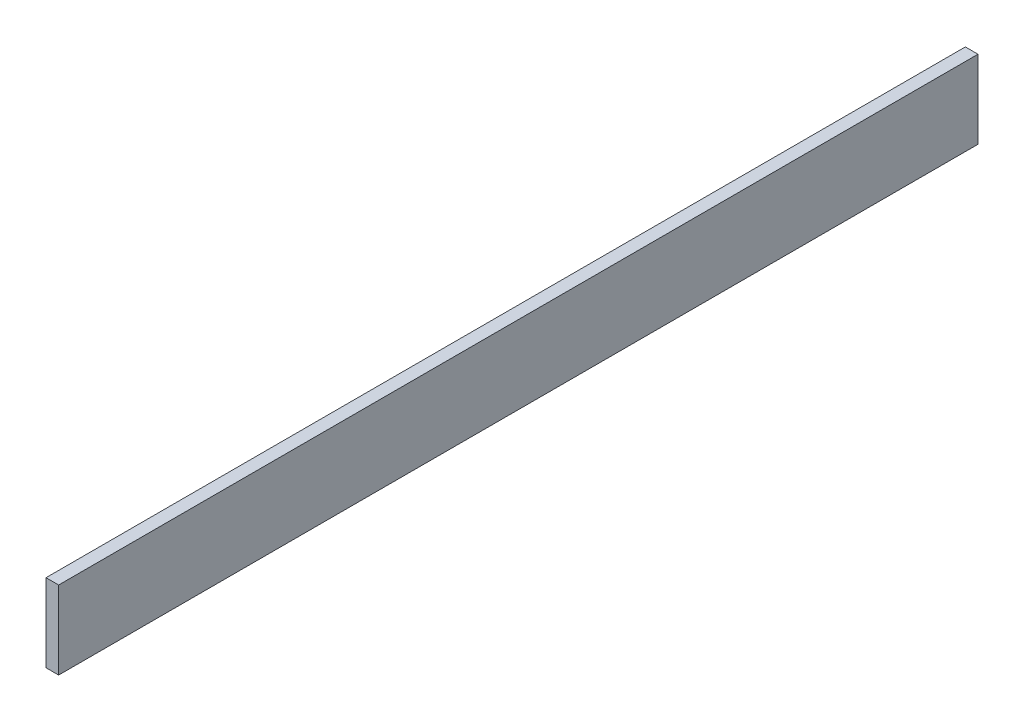
ISO-10303-21;
HEADER;
FILE_DESCRIPTION(('STEP AP214'),'2;1');
FILE_NAME('part.step','',(''),(''),'','','');
FILE_SCHEMA(('AUTOMOTIVE_DESIGN { 1 0 10303 214 1 1 1 1 }'));
ENDSEC;
DATA;
#1=APPLICATION_CONTEXT('core data for automotive mechanical design processes');
#2=APPLICATION_PROTOCOL_DEFINITION('international standard','automotive_design',2000,#1);
#3=PRODUCT_CONTEXT('',#1,'mechanical');
#4=PRODUCT('Part','Part','',(#3));
#5=PRODUCT_RELATED_PRODUCT_CATEGORY('part','',(#4));
#6=PRODUCT_DEFINITION_FORMATION('','',#4);
#7=PRODUCT_DEFINITION_CONTEXT('part definition',#1,'design');
#8=PRODUCT_DEFINITION('design','',#6,#7);
#9=PRODUCT_DEFINITION_SHAPE('','',#8);
#10=(LENGTH_UNIT() NAMED_UNIT(*) SI_UNIT(.MILLI.,.METRE.));
#11=(NAMED_UNIT(*) PLANE_ANGLE_UNIT() SI_UNIT($,.RADIAN.));
#12=(NAMED_UNIT(*) SI_UNIT($,.STERADIAN.) SOLID_ANGLE_UNIT());
#13=UNCERTAINTY_MEASURE_WITH_UNIT(LENGTH_MEASURE(1.E-05),#10,'distance_accuracy_value','');
#14=(GEOMETRIC_REPRESENTATION_CONTEXT(3) GLOBAL_UNCERTAINTY_ASSIGNED_CONTEXT((#13)) GLOBAL_UNIT_ASSIGNED_CONTEXT((#10,
#11,#12)) REPRESENTATION_CONTEXT('',''));
#15=CARTESIAN_POINT('',(0.,0.,0.));
#16=DIRECTION('',(0.,0.,1.));
#17=DIRECTION('',(1.,0.,0.));
#18=AXIS2_PLACEMENT_3D('',#15,#16,#17);
#19=CARTESIAN_POINT('',(38.1,0.,0.));
#20=DIRECTION('',(0.,0.,-1.));
#21=DIRECTION('',(-1.,0.,0.));
#22=AXIS2_PLACEMENT_3D('',#19,#20,#21);
#23=PLANE('',#22);
#24=DIRECTION('',(0.,-1.,0.));
#25=VECTOR('',#24,1.);
#26=CARTESIAN_POINT('',(0.,0.,0.));
#27=LINE('',#26,#25);
#28=CARTESIAN_POINT('',(0.,234.95,0.));
#29=VERTEX_POINT('',#28);
#30=CARTESIAN_POINT('',(0.,0.,0.));
#31=VERTEX_POINT('',#30);
#32=EDGE_CURVE('E96',#29,#31,#27,.T.);
#33=ORIENTED_EDGE('',*,*,#32,.T.);
#34=DIRECTION('',(-1.,0.,0.));
#35=VECTOR('',#34,1.);
#36=CARTESIAN_POINT('',(38.1,0.,0.));
#37=LINE('',#36,#35);
#38=CARTESIAN_POINT('',(38.1,0.,0.));
#39=VERTEX_POINT('',#38);
#40=EDGE_CURVE('E11',#39,#31,#37,.T.);
#41=ORIENTED_EDGE('',*,*,#40,.F.);
#42=DIRECTION('',(0.,-1.,0.));
#43=VECTOR('',#42,1.);
#44=CARTESIAN_POINT('',(38.1,0.,0.));
#45=LINE('',#44,#43);
#46=CARTESIAN_POINT('',(38.1,234.95,0.));
#47=VERTEX_POINT('',#46);
#48=EDGE_CURVE('E84',#47,#39,#45,.T.);
#49=ORIENTED_EDGE('',*,*,#48,.F.);
#50=DIRECTION('',(-1.,0.,0.));
#51=VECTOR('',#50,1.);
#52=CARTESIAN_POINT('',(38.1,234.95,0.));
#53=LINE('',#52,#51);
#54=EDGE_CURVE('E92',#47,#29,#53,.T.);
#55=ORIENTED_EDGE('',*,*,#54,.T.);
#56=EDGE_LOOP('',(#33,#41,#49,#55));
#57=FACE_BOUND('',#56,.T.);
#58=ADVANCED_FACE('F33',(#57),#23,.F.);
#59=CARTESIAN_POINT('',(38.1,0.,0.));
#60=DIRECTION('',(0.,1.,0.));
#61=DIRECTION('',(0.,0.,1.));
#62=AXIS2_PLACEMENT_3D('',#59,#60,#61);
#63=PLANE('',#62);
#64=DIRECTION('',(0.,0.,-1.));
#65=VECTOR('',#64,1.);
#66=CARTESIAN_POINT('',(0.,0.,0.));
#67=LINE('',#66,#65);
#68=CARTESIAN_POINT('',(0.,0.,-2768.6));
#69=VERTEX_POINT('',#68);
#70=EDGE_CURVE('E88',#31,#69,#67,.T.);
#71=ORIENTED_EDGE('',*,*,#70,.T.);
#72=DIRECTION('',(-1.,0.,0.));
#73=VECTOR('',#72,1.);
#74=CARTESIAN_POINT('',(38.1,0.,-2768.6));
#75=LINE('',#74,#73);
#76=CARTESIAN_POINT('',(38.1,0.,-2768.6));
#77=VERTEX_POINT('',#76);
#78=EDGE_CURVE('E41',#77,#69,#75,.T.);
#79=ORIENTED_EDGE('',*,*,#78,.F.);
#80=DIRECTION('',(0.,0.,-1.));
#81=VECTOR('',#80,1.);
#82=CARTESIAN_POINT('',(38.1,0.,0.));
#83=LINE('',#82,#81);
#84=EDGE_CURVE('E79',#39,#77,#83,.T.);
#85=ORIENTED_EDGE('',*,*,#84,.F.);
#86=ORIENTED_EDGE('',*,*,#40,.T.);
#87=EDGE_LOOP('',(#71,#79,#85,#86));
#88=FACE_BOUND('',#87,.T.);
#89=ADVANCED_FACE('F87',(#88),#63,.F.);
#90=CARTESIAN_POINT('',(38.1,0.,-2768.6));
#91=DIRECTION('',(0.,0.,1.));
#92=DIRECTION('',(1.,0.,0.));
#93=AXIS2_PLACEMENT_3D('',#90,#91,#92);
#94=PLANE('',#93);
#95=DIRECTION('',(0.,1.,0.));
#96=VECTOR('',#95,1.);
#97=CARTESIAN_POINT('',(0.,0.,-2768.6));
#98=LINE('',#97,#96);
#99=CARTESIAN_POINT('',(0.,234.95,-2768.6));
#100=VERTEX_POINT('',#99);
#101=EDGE_CURVE('E66',#69,#100,#98,.T.);
#102=ORIENTED_EDGE('',*,*,#101,.T.);
#103=DIRECTION('',(-1.,0.,0.));
#104=VECTOR('',#103,1.);
#105=CARTESIAN_POINT('',(38.1,234.95,-2768.6));
#106=LINE('',#105,#104);
#107=CARTESIAN_POINT('',(38.1,234.95,-2768.6));
#108=VERTEX_POINT('',#107);
#109=EDGE_CURVE('E89',#108,#100,#106,.T.);
#110=ORIENTED_EDGE('',*,*,#109,.F.);
#111=DIRECTION('',(0.,1.,0.));
#112=VECTOR('',#111,1.);
#113=CARTESIAN_POINT('',(38.1,0.,-2768.6));
#114=LINE('',#113,#112);
#115=EDGE_CURVE('E82',#77,#108,#114,.T.);
#116=ORIENTED_EDGE('',*,*,#115,.F.);
#117=ORIENTED_EDGE('',*,*,#78,.T.);
#118=EDGE_LOOP('',(#102,#110,#116,#117));
#119=FACE_BOUND('',#118,.T.);
#120=ADVANCED_FACE('F90',(#119),#94,.F.);
#121=CARTESIAN_POINT('',(38.1,234.95,0.));
#122=DIRECTION('',(0.,-1.,0.));
#123=DIRECTION('',(0.,0.,-1.));
#124=AXIS2_PLACEMENT_3D('',#121,#122,#123);
#125=PLANE('',#124);
#126=DIRECTION('',(0.,0.,1.));
#127=VECTOR('',#126,1.);
#128=CARTESIAN_POINT('',(0.,234.95,0.));
#129=LINE('',#128,#127);
#130=EDGE_CURVE('E72',#100,#29,#129,.T.);
#131=ORIENTED_EDGE('',*,*,#130,.T.);
#132=ORIENTED_EDGE('',*,*,#54,.F.);
#133=DIRECTION('',(0.,0.,1.));
#134=VECTOR('',#133,1.);
#135=CARTESIAN_POINT('',(38.1,234.95,0.));
#136=LINE('',#135,#134);
#137=EDGE_CURVE('E49',#108,#47,#136,.T.);
#138=ORIENTED_EDGE('',*,*,#137,.F.);
#139=ORIENTED_EDGE('',*,*,#109,.T.);
#140=EDGE_LOOP('',(#131,#132,#138,#139));
#141=FACE_BOUND('',#140,.T.);
#142=ADVANCED_FACE('F103',(#141),#125,.F.);
#143=CARTESIAN_POINT('',(38.1,0.,0.));
#144=DIRECTION('',(-1.,0.,0.));
#145=DIRECTION('',(0.,0.,1.));
#146=AXIS2_PLACEMENT_3D('',#143,#144,#145);
#147=PLANE('',#146);
#148=ORIENTED_EDGE('',*,*,#48,.T.);
#149=ORIENTED_EDGE('',*,*,#84,.T.);
#150=ORIENTED_EDGE('',*,*,#115,.T.);
#151=ORIENTED_EDGE('',*,*,#137,.T.);
#152=EDGE_LOOP('',(#148,#149,#150,#151));
#153=FACE_BOUND('',#152,.T.);
#154=ADVANCED_FACE('F80',(#153),#147,.F.);
#155=CARTESIAN_POINT('',(0.,0.,0.));
#156=DIRECTION('',(-1.,0.,0.));
#157=DIRECTION('',(0.,0.,1.));
#158=AXIS2_PLACEMENT_3D('',#155,#156,#157);
#159=PLANE('',#158);
#160=ORIENTED_EDGE('',*,*,#32,.F.);
#161=ORIENTED_EDGE('',*,*,#130,.F.);
#162=ORIENTED_EDGE('',*,*,#101,.F.);
#163=ORIENTED_EDGE('',*,*,#70,.F.);
#164=EDGE_LOOP('',(#160,#161,#162,#163));
#165=FACE_BOUND('',#164,.T.);
#166=ADVANCED_FACE('F106',(#165),#159,.T.);
#167=CLOSED_SHELL('',(#58,#89,#120,#142,#154,#166));
#168=MANIFOLD_SOLID_BREP('B2',#167);
#169=ADVANCED_BREP_SHAPE_REPRESENTATION('',(#18,#168),#14);
#170=SHAPE_DEFINITION_REPRESENTATION(#9,#169);
ENDSEC;
END-ISO-10303-21;
